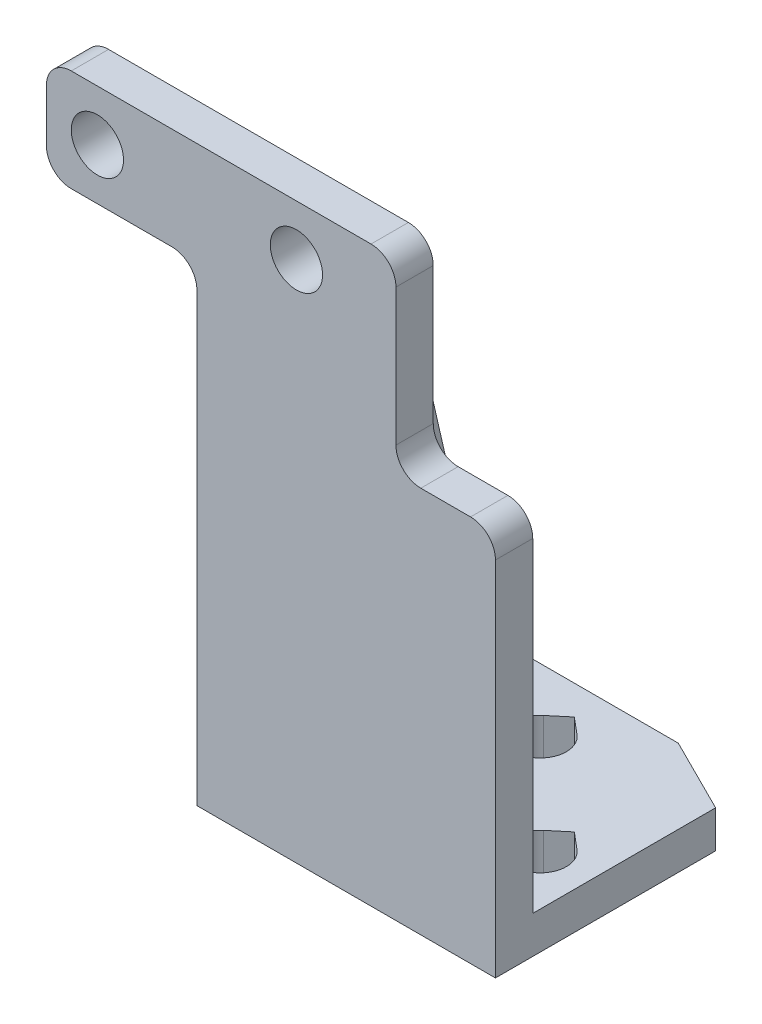
ISO-10303-21;
HEADER;
FILE_DESCRIPTION(('STEP AP214'),'2;1');
FILE_NAME('part.step','',(''),(''),'','','');
FILE_SCHEMA(('AUTOMOTIVE_DESIGN { 1 0 10303 214 1 1 1 1 }'));
ENDSEC;
DATA;
#1=APPLICATION_CONTEXT('core data for automotive mechanical design processes');
#2=APPLICATION_PROTOCOL_DEFINITION('international standard','automotive_design',2000,#1);
#3=PRODUCT_CONTEXT('',#1,'mechanical');
#4=PRODUCT('Part','Part','',(#3));
#5=PRODUCT_RELATED_PRODUCT_CATEGORY('part','',(#4));
#6=PRODUCT_DEFINITION_FORMATION('','',#4);
#7=PRODUCT_DEFINITION_CONTEXT('part definition',#1,'design');
#8=PRODUCT_DEFINITION('design','',#6,#7);
#9=PRODUCT_DEFINITION_SHAPE('','',#8);
#10=(LENGTH_UNIT() NAMED_UNIT(*) SI_UNIT(.MILLI.,.METRE.));
#11=(NAMED_UNIT(*) PLANE_ANGLE_UNIT() SI_UNIT($,.RADIAN.));
#12=(NAMED_UNIT(*) SI_UNIT($,.STERADIAN.) SOLID_ANGLE_UNIT());
#13=UNCERTAINTY_MEASURE_WITH_UNIT(LENGTH_MEASURE(1.E-05),#10,'distance_accuracy_value','');
#14=(GEOMETRIC_REPRESENTATION_CONTEXT(3) GLOBAL_UNCERTAINTY_ASSIGNED_CONTEXT((#13)) GLOBAL_UNIT_ASSIGNED_CONTEXT((#10,
#11,#12)) REPRESENTATION_CONTEXT('',''));
#15=CARTESIAN_POINT('',(0.,0.,0.));
#16=DIRECTION('',(0.,0.,1.));
#17=DIRECTION('',(1.,0.,0.));
#18=AXIS2_PLACEMENT_3D('',#15,#16,#17);
#19=CARTESIAN_POINT('',(0.,3.,0.));
#20=DIRECTION('',(0.,-1.,0.));
#21=DIRECTION('',(0.,0.,1.));
#22=AXIS2_PLACEMENT_3D('',#19,#20,#21);
#23=PLANE('',#22);
#24=CARTESIAN_POINT('',(0.,3.,-12.6));
#25=DIRECTION('',(0.,-1.,0.));
#26=DIRECTION('',(0.,0.,-1.));
#27=AXIS2_PLACEMENT_3D('',#24,#25,#26);
#28=CIRCLE('',#27,2.1);
#29=CARTESIAN_POINT('',(1.34985398034174,3.,-14.2086933305499));
#30=VERTEX_POINT('',#29);
#31=CARTESIAN_POINT('',(-1.34985398034174,3.,-14.2086933305499));
#32=VERTEX_POINT('',#31);
#33=EDGE_CURVE('E381',#30,#32,#28,.T.);
#34=ORIENTED_EDGE('',*,*,#33,.T.);
#35=DIRECTION('',(0.766044443118976,0.,-0.642787609686541));
#36=VECTOR('',#35,1.);
#37=CARTESIAN_POINT('',(-1.34985398034174,3.,-14.2086933305499));
#38=LINE('',#37,#36);
#39=CARTESIAN_POINT('',(0.,3.,-15.3413553075978));
#40=VERTEX_POINT('',#39);
#41=EDGE_CURVE('E384',#32,#40,#38,.T.);
#42=ORIENTED_EDGE('',*,*,#41,.T.);
#43=DIRECTION('',(0.766044443118977,0.,0.64278760968654));
#44=VECTOR('',#43,1.);
#45=CARTESIAN_POINT('',(0.,3.,-15.3413553075978));
#46=LINE('',#45,#44);
#47=EDGE_CURVE('E388',#40,#30,#46,.T.);
#48=ORIENTED_EDGE('',*,*,#47,.T.);
#49=EDGE_LOOP('',(#34,#42,#48));
#50=FACE_BOUND('',#49,.T.);
#51=CARTESIAN_POINT('',(-8.,3.,-4.6));
#52=DIRECTION('',(0.,-1.,0.));
#53=DIRECTION('',(0.,0.,-1.));
#54=AXIS2_PLACEMENT_3D('',#51,#52,#53);
#55=CIRCLE('',#54,2.1);
#56=CARTESIAN_POINT('',(-6.65014601965826,3.,-6.20869333054985));
#57=VERTEX_POINT('',#56);
#58=CARTESIAN_POINT('',(-9.34985398034174,3.,-6.20869333054985));
#59=VERTEX_POINT('',#58);
#60=EDGE_CURVE('E431',#57,#59,#55,.T.);
#61=ORIENTED_EDGE('',*,*,#60,.T.);
#62=DIRECTION('',(0.766044443118977,0.,-0.64278760968654));
#63=VECTOR('',#62,1.);
#64=CARTESIAN_POINT('',(-9.34985398034174,3.,-6.20869333054985));
#65=LINE('',#64,#63);
#66=CARTESIAN_POINT('',(-8.,3.,-7.34135530759779));
#67=VERTEX_POINT('',#66);
#68=EDGE_CURVE('E434',#59,#67,#65,.T.);
#69=ORIENTED_EDGE('',*,*,#68,.T.);
#70=DIRECTION('',(0.766044443118976,0.,0.642787609686542));
#71=VECTOR('',#70,1.);
#72=CARTESIAN_POINT('',(-8.,3.,-7.34135530759779));
#73=LINE('',#72,#71);
#74=EDGE_CURVE('E438',#67,#57,#73,.T.);
#75=ORIENTED_EDGE('',*,*,#74,.T.);
#76=EDGE_LOOP('',(#61,#69,#75));
#77=FACE_BOUND('',#76,.T.);
#78=CARTESIAN_POINT('',(8.,3.,-4.6));
#79=DIRECTION('',(0.,-1.,0.));
#80=DIRECTION('',(0.,0.,-1.));
#81=AXIS2_PLACEMENT_3D('',#78,#79,#80);
#82=CIRCLE('',#81,2.1);
#83=CARTESIAN_POINT('',(9.34985398034174,3.,-6.20869333054985));
#84=VERTEX_POINT('',#83);
#85=CARTESIAN_POINT('',(6.65014601965826,3.,-6.20869333054985));
#86=VERTEX_POINT('',#85);
#87=EDGE_CURVE('E407',#84,#86,#82,.T.);
#88=ORIENTED_EDGE('',*,*,#87,.T.);
#89=DIRECTION('',(0.766044443118977,0.,-0.642787609686541));
#90=VECTOR('',#89,1.);
#91=CARTESIAN_POINT('',(6.65014601965826,3.,-6.20869333054985));
#92=LINE('',#91,#90);
#93=CARTESIAN_POINT('',(8.,3.,-7.34135530759779));
#94=VERTEX_POINT('',#93);
#95=EDGE_CURVE('E410',#86,#94,#92,.T.);
#96=ORIENTED_EDGE('',*,*,#95,.T.);
#97=DIRECTION('',(0.766044443118976,0.,0.642787609686542));
#98=VECTOR('',#97,1.);
#99=CARTESIAN_POINT('',(8.,3.,-7.34135530759779));
#100=LINE('',#99,#98);
#101=EDGE_CURVE('E414',#94,#84,#100,.T.);
#102=ORIENTED_EDGE('',*,*,#101,.T.);
#103=EDGE_LOOP('',(#88,#96,#102));
#104=FACE_BOUND('',#103,.T.);
#105=DIRECTION('',(0.,0.,-1.));
#106=VECTOR('',#105,1.);
#107=CARTESIAN_POINT('',(-12.,3.,-17.7));
#108=LINE('',#107,#106);
#109=CARTESIAN_POINT('',(-12.,3.,0.));
#110=VERTEX_POINT('',#109);
#111=CARTESIAN_POINT('',(-12.,3.,-14.7));
#112=VERTEX_POINT('',#111);
#113=EDGE_CURVE('E254',#110,#112,#108,.T.);
#114=ORIENTED_EDGE('',*,*,#113,.F.);
#115=DIRECTION('',(-1.,0.,0.));
#116=VECTOR('',#115,1.);
#117=CARTESIAN_POINT('',(-12.,3.,0.));
#118=LINE('',#117,#116);
#119=CARTESIAN_POINT('',(-3.,3.,0.));
#120=VERTEX_POINT('',#119);
#121=EDGE_CURVE('E236',#120,#110,#118,.T.);
#122=ORIENTED_EDGE('',*,*,#121,.F.);
#123=DIRECTION('',(0.,0.,1.));
#124=VECTOR('',#123,1.);
#125=CARTESIAN_POINT('',(-3.,3.,0.));
#126=LINE('',#125,#124);
#127=CARTESIAN_POINT('',(-3.,3.,-8.));
#128=VERTEX_POINT('',#127);
#129=EDGE_CURVE('E245',#128,#120,#126,.T.);
#130=ORIENTED_EDGE('',*,*,#129,.F.);
#131=DIRECTION('',(-1.,0.,0.));
#132=VECTOR('',#131,1.);
#133=CARTESIAN_POINT('',(3.,3.,-8.));
#134=LINE('',#133,#132);
#135=CARTESIAN_POINT('',(3.,3.,-8.));
#136=VERTEX_POINT('',#135);
#137=EDGE_CURVE('E765',#136,#128,#134,.T.);
#138=ORIENTED_EDGE('',*,*,#137,.F.);
#139=DIRECTION('',(0.,0.,1.));
#140=VECTOR('',#139,1.);
#141=CARTESIAN_POINT('',(3.,3.,0.));
#142=LINE('',#141,#140);
#143=CARTESIAN_POINT('',(3.,3.,0.));
#144=VERTEX_POINT('',#143);
#145=EDGE_CURVE('E760',#136,#144,#142,.T.);
#146=ORIENTED_EDGE('',*,*,#145,.T.);
#147=CARTESIAN_POINT('',(12.,3.,0.));
#148=VERTEX_POINT('',#147);
#149=EDGE_CURVE('E255',#148,#144,#118,.T.);
#150=ORIENTED_EDGE('',*,*,#149,.F.);
#151=DIRECTION('',(0.,0.,1.));
#152=VECTOR('',#151,1.);
#153=CARTESIAN_POINT('',(12.,3.,-17.7));
#154=LINE('',#153,#152);
#155=CARTESIAN_POINT('',(12.,3.,-14.7));
#156=VERTEX_POINT('',#155);
#157=EDGE_CURVE('E256',#156,#148,#154,.T.);
#158=ORIENTED_EDGE('',*,*,#157,.F.);
#159=DIRECTION('',(-0.894427190999917,0.,-0.447213595499956));
#160=VECTOR('',#159,1.);
#161=CARTESIAN_POINT('',(12.,3.,-14.7));
#162=LINE('',#161,#160);
#163=CARTESIAN_POINT('',(5.99999999999996,3.,-17.7));
#164=VERTEX_POINT('',#163);
#165=EDGE_CURVE('E284',#164,#156,#162,.F.);
#166=ORIENTED_EDGE('',*,*,#165,.F.);
#167=DIRECTION('',(1.,0.,0.));
#168=VECTOR('',#167,1.);
#169=CARTESIAN_POINT('',(-12.,3.,-17.7));
#170=LINE('',#169,#168);
#171=CARTESIAN_POINT('',(-5.99999999999996,3.,-17.7));
#172=VERTEX_POINT('',#171);
#173=EDGE_CURVE('E265',#172,#164,#170,.T.);
#174=ORIENTED_EDGE('',*,*,#173,.F.);
#175=DIRECTION('',(-0.894427190999917,0.,0.447213595499957));
#176=VECTOR('',#175,1.);
#177=CARTESIAN_POINT('',(-5.99999999999995,3.,-17.7));
#178=LINE('',#177,#176);
#179=EDGE_CURVE('E294',#112,#172,#178,.F.);
#180=ORIENTED_EDGE('',*,*,#179,.F.);
#181=EDGE_LOOP('',(#114,#122,#130,#138,#146,#150,#158,#166,#174,#180));
#182=FACE_BOUND('',#181,.T.);
#183=ADVANCED_FACE('F35',(#50,#77,#104,#182),#23,.F.);
#184=CARTESIAN_POINT('',(0.,0.,0.));
#185=DIRECTION('',(0.,0.,-1.));
#186=DIRECTION('',(1.,0.,0.));
#187=AXIS2_PLACEMENT_3D('',#184,#185,#186);
#188=PLANE('',#187);
#189=CARTESIAN_POINT('',(-20.,42.,0.));
#190=DIRECTION('',(0.,0.,1.));
#191=DIRECTION('',(1.,0.,0.));
#192=AXIS2_PLACEMENT_3D('',#189,#190,#191);
#193=CIRCLE('',#192,2.1);
#194=CARTESIAN_POINT('',(-17.9,42.,0.));
#195=VERTEX_POINT('',#194);
#196=EDGE_CURVE('E585',#195,#195,#193,.T.);
#197=ORIENTED_EDGE('',*,*,#196,.T.);
#198=EDGE_LOOP('',(#197));
#199=FACE_BOUND('',#198,.T.);
#200=CARTESIAN_POINT('',(-4.,42.,0.));
#201=DIRECTION('',(0.,0.,1.));
#202=DIRECTION('',(1.,0.,0.));
#203=AXIS2_PLACEMENT_3D('',#200,#201,#202);
#204=CIRCLE('',#203,2.1);
#205=CARTESIAN_POINT('',(-1.9,42.,0.));
#206=VERTEX_POINT('',#205);
#207=EDGE_CURVE('E593',#206,#206,#204,.T.);
#208=ORIENTED_EDGE('',*,*,#207,.T.);
#209=EDGE_LOOP('',(#208));
#210=FACE_BOUND('',#209,.T.);
#211=DIRECTION('',(0.,1.,0.));
#212=VECTOR('',#211,1.);
#213=CARTESIAN_POINT('',(12.,0.,0.));
#214=LINE('',#213,#212);
#215=CARTESIAN_POINT('',(12.,29.1,0.));
#216=VERTEX_POINT('',#215);
#217=EDGE_CURVE('E369',#148,#216,#214,.T.);
#218=ORIENTED_EDGE('',*,*,#217,.F.);
#219=ORIENTED_EDGE('',*,*,#149,.T.);
#220=DIRECTION('',(0.,1.,0.));
#221=VECTOR('',#220,1.);
#222=CARTESIAN_POINT('',(3.,38.,0.));
#223=LINE('',#222,#221);
#224=CARTESIAN_POINT('',(3.,38.,0.));
#225=VERTEX_POINT('',#224);
#226=EDGE_CURVE('E250',#144,#225,#223,.T.);
#227=ORIENTED_EDGE('',*,*,#226,.T.);
#228=DIRECTION('',(-1.,0.,0.));
#229=VECTOR('',#228,1.);
#230=CARTESIAN_POINT('',(3.,38.,0.));
#231=LINE('',#230,#229);
#232=CARTESIAN_POINT('',(-3.,38.,0.));
#233=VERTEX_POINT('',#232);
#234=EDGE_CURVE('E240',#225,#233,#231,.T.);
#235=ORIENTED_EDGE('',*,*,#234,.T.);
#236=DIRECTION('',(0.,1.,0.));
#237=VECTOR('',#236,1.);
#238=CARTESIAN_POINT('',(-3.,38.,0.));
#239=LINE('',#238,#237);
#240=EDGE_CURVE('E231',#120,#233,#239,.T.);
#241=ORIENTED_EDGE('',*,*,#240,.F.);
#242=ORIENTED_EDGE('',*,*,#121,.T.);
#243=DIRECTION('',(0.,-1.,0.));
#244=VECTOR('',#243,1.);
#245=CARTESIAN_POINT('',(-12.,0.,0.));
#246=LINE('',#245,#244);
#247=CARTESIAN_POINT('',(-12.,35.9,0.));
#248=VERTEX_POINT('',#247);
#249=EDGE_CURVE('E378',#248,#110,#246,.T.);
#250=ORIENTED_EDGE('',*,*,#249,.F.);
#251=CARTESIAN_POINT('',(-14.,35.9,0.));
#252=DIRECTION('',(0.,0.,1.));
#253=DIRECTION('',(1.,0.,0.));
#254=AXIS2_PLACEMENT_3D('',#251,#252,#253);
#255=CIRCLE('',#254,2.);
#256=CARTESIAN_POINT('',(-14.,37.9,0.));
#257=VERTEX_POINT('',#256);
#258=EDGE_CURVE('E344',#257,#248,#255,.F.);
#259=ORIENTED_EDGE('',*,*,#258,.F.);
#260=DIRECTION('',(1.,0.,0.));
#261=VECTOR('',#260,1.);
#262=CARTESIAN_POINT('',(-12.,37.9,0.));
#263=LINE('',#262,#261);
#264=CARTESIAN_POINT('',(-22.1,37.9,0.));
#265=VERTEX_POINT('',#264);
#266=EDGE_CURVE('E375',#265,#257,#263,.T.);
#267=ORIENTED_EDGE('',*,*,#266,.F.);
#268=CARTESIAN_POINT('',(-22.1,39.9,0.));
#269=DIRECTION('',(0.,0.,1.));
#270=DIRECTION('',(1.,0.,0.));
#271=AXIS2_PLACEMENT_3D('',#268,#269,#270);
#272=CIRCLE('',#271,2.);
#273=CARTESIAN_POINT('',(-24.1,39.9,0.));
#274=VERTEX_POINT('',#273);
#275=EDGE_CURVE('E310',#274,#265,#272,.T.);
#276=ORIENTED_EDGE('',*,*,#275,.F.);
#277=DIRECTION('',(0.,-1.,0.));
#278=VECTOR('',#277,1.);
#279=CARTESIAN_POINT('',(-24.1,46.1,0.));
#280=LINE('',#279,#278);
#281=CARTESIAN_POINT('',(-24.1,44.1,0.));
#282=VERTEX_POINT('',#281);
#283=EDGE_CURVE('E367',#282,#274,#280,.T.);
#284=ORIENTED_EDGE('',*,*,#283,.F.);
#285=CARTESIAN_POINT('',(-22.1,44.1,0.));
#286=DIRECTION('',(0.,0.,1.));
#287=DIRECTION('',(1.,0.,0.));
#288=AXIS2_PLACEMENT_3D('',#285,#286,#287);
#289=CIRCLE('',#288,2.);
#290=CARTESIAN_POINT('',(-22.1,46.1,0.));
#291=VERTEX_POINT('',#290);
#292=EDGE_CURVE('E307',#291,#282,#289,.T.);
#293=ORIENTED_EDGE('',*,*,#292,.F.);
#294=DIRECTION('',(-1.,0.,0.));
#295=VECTOR('',#294,1.);
#296=CARTESIAN_POINT('',(-12.,46.1,0.));
#297=LINE('',#296,#295);
#298=CARTESIAN_POINT('',(2.,46.1,0.));
#299=VERTEX_POINT('',#298);
#300=EDGE_CURVE('E363',#299,#291,#297,.T.);
#301=ORIENTED_EDGE('',*,*,#300,.F.);
#302=CARTESIAN_POINT('',(2.,44.1,0.));
#303=DIRECTION('',(0.,0.,1.));
#304=DIRECTION('',(1.,0.,0.));
#305=AXIS2_PLACEMENT_3D('',#302,#303,#304);
#306=CIRCLE('',#305,2.);
#307=CARTESIAN_POINT('',(4.,44.1,0.));
#308=VERTEX_POINT('',#307);
#309=EDGE_CURVE('E313',#308,#299,#306,.T.);
#310=ORIENTED_EDGE('',*,*,#309,.F.);
#311=DIRECTION('',(0.,1.,0.));
#312=VECTOR('',#311,1.);
#313=CARTESIAN_POINT('',(4.,31.1,0.));
#314=LINE('',#313,#312);
#315=CARTESIAN_POINT('',(4.,33.1,0.));
#316=VERTEX_POINT('',#315);
#317=EDGE_CURVE('E359',#316,#308,#314,.T.);
#318=ORIENTED_EDGE('',*,*,#317,.F.);
#319=CARTESIAN_POINT('',(6.,33.1,0.));
#320=DIRECTION('',(0.,0.,1.));
#321=DIRECTION('',(1.,0.,0.));
#322=AXIS2_PLACEMENT_3D('',#319,#320,#321);
#323=CIRCLE('',#322,2.);
#324=CARTESIAN_POINT('',(6.,31.1,0.));
#325=VERTEX_POINT('',#324);
#326=EDGE_CURVE('E43',#325,#316,#323,.F.);
#327=ORIENTED_EDGE('',*,*,#326,.F.);
#328=DIRECTION('',(-1.,0.,0.));
#329=VECTOR('',#328,1.);
#330=CARTESIAN_POINT('',(12.,31.1,0.));
#331=LINE('',#330,#329);
#332=CARTESIAN_POINT('',(10.,31.1,0.));
#333=VERTEX_POINT('',#332);
#334=EDGE_CURVE('E364',#333,#325,#331,.T.);
#335=ORIENTED_EDGE('',*,*,#334,.F.);
#336=CARTESIAN_POINT('',(10.,29.1,0.));
#337=DIRECTION('',(0.,0.,1.));
#338=DIRECTION('',(1.,0.,0.));
#339=AXIS2_PLACEMENT_3D('',#336,#337,#338);
#340=CIRCLE('',#339,2.);
#341=EDGE_CURVE('E316',#216,#333,#340,.T.);
#342=ORIENTED_EDGE('',*,*,#341,.F.);
#343=EDGE_LOOP('',(#218,#219,#227,#235,#241,#242,#250,#259,#267,#276,#284,#293,#301,#310,#318,
#327,#335,#342));
#344=FACE_BOUND('',#343,.T.);
#345=ADVANCED_FACE('F233',(#199,#210,#344),#188,.T.);
#346=CARTESIAN_POINT('',(0.,0.,0.));
#347=DIRECTION('',(0.,-1.,0.));
#348=DIRECTION('',(0.,0.,1.));
#349=AXIS2_PLACEMENT_3D('',#346,#347,#348);
#350=PLANE('',#349);
#351=DIRECTION('',(1.,0.,0.));
#352=VECTOR('',#351,1.);
#353=CARTESIAN_POINT('',(-12.,0.,-17.7));
#354=LINE('',#353,#352);
#355=CARTESIAN_POINT('',(-5.99999999999996,0.,-17.7));
#356=VERTEX_POINT('',#355);
#357=CARTESIAN_POINT('',(5.99999999999996,0.,-17.7));
#358=VERTEX_POINT('',#357);
#359=EDGE_CURVE('E260',#356,#358,#354,.T.);
#360=ORIENTED_EDGE('',*,*,#359,.T.);
#361=DIRECTION('',(0.894427190999917,0.,0.447213595499956));
#362=VECTOR('',#361,1.);
#363=CARTESIAN_POINT('',(8.27999999999996,0.,-16.56));
#364=LINE('',#363,#362);
#365=CARTESIAN_POINT('',(12.,0.,-14.7));
#366=VERTEX_POINT('',#365);
#367=EDGE_CURVE('E279',#366,#358,#364,.F.);
#368=ORIENTED_EDGE('',*,*,#367,.F.);
#369=DIRECTION('',(0.,0.,1.));
#370=VECTOR('',#369,1.);
#371=CARTESIAN_POINT('',(12.,0.,-17.7));
#372=LINE('',#371,#370);
#373=CARTESIAN_POINT('',(12.,0.,3.));
#374=VERTEX_POINT('',#373);
#375=EDGE_CURVE('E269',#366,#374,#372,.T.);
#376=ORIENTED_EDGE('',*,*,#375,.T.);
#377=DIRECTION('',(1.,0.,0.));
#378=VECTOR('',#377,1.);
#379=CARTESIAN_POINT('',(12.,0.,3.));
#380=LINE('',#379,#378);
#381=CARTESIAN_POINT('',(-12.,0.,3.));
#382=VERTEX_POINT('',#381);
#383=EDGE_CURVE('E396',#382,#374,#380,.T.);
#384=ORIENTED_EDGE('',*,*,#383,.F.);
#385=DIRECTION('',(0.,0.,-1.));
#386=VECTOR('',#385,1.);
#387=CARTESIAN_POINT('',(-12.,0.,-17.7));
#388=LINE('',#387,#386);
#389=CARTESIAN_POINT('',(-12.,0.,-14.7));
#390=VERTEX_POINT('',#389);
#391=EDGE_CURVE('E272',#382,#390,#388,.T.);
#392=ORIENTED_EDGE('',*,*,#391,.T.);
#393=DIRECTION('',(0.894427190999917,0.,-0.447213595499957));
#394=VECTOR('',#393,1.);
#395=CARTESIAN_POINT('',(-8.27999999999997,0.,-16.56));
#396=LINE('',#395,#394);
#397=EDGE_CURVE('E289',#356,#390,#396,.F.);
#398=ORIENTED_EDGE('',*,*,#397,.F.);
#399=EDGE_LOOP('',(#360,#368,#376,#384,#392,#398));
#400=FACE_BOUND('',#399,.T.);
#401=DIRECTION('',(0.766044443118976,0.,0.642787609686542));
#402=VECTOR('',#401,1.);
#403=CARTESIAN_POINT('',(-8.,0.,-7.34135530759779));
#404=LINE('',#403,#402);
#405=CARTESIAN_POINT('',(-8.,0.,-7.34135530759779));
#406=VERTEX_POINT('',#405);
#407=CARTESIAN_POINT('',(-6.65014601965826,0.,-6.20869333054985));
#408=VERTEX_POINT('',#407);
#409=EDGE_CURVE('E435',#406,#408,#404,.T.);
#410=ORIENTED_EDGE('',*,*,#409,.F.);
#411=DIRECTION('',(0.766044443118977,0.,-0.64278760968654));
#412=VECTOR('',#411,1.);
#413=CARTESIAN_POINT('',(-9.34985398034174,0.,-6.20869333054985));
#414=LINE('',#413,#412);
#415=CARTESIAN_POINT('',(-9.34985398034174,0.,-6.20869333054985));
#416=VERTEX_POINT('',#415);
#417=EDGE_CURVE('E444',#416,#406,#414,.T.);
#418=ORIENTED_EDGE('',*,*,#417,.F.);
#419=CARTESIAN_POINT('',(-8.,0.,-4.6));
#420=DIRECTION('',(0.,-1.,0.));
#421=DIRECTION('',(0.,0.,-1.));
#422=AXIS2_PLACEMENT_3D('',#419,#420,#421);
#423=CIRCLE('',#422,2.1);
#424=EDGE_CURVE('E430',#408,#416,#423,.T.);
#425=ORIENTED_EDGE('',*,*,#424,.F.);
#426=EDGE_LOOP('',(#410,#418,#425));
#427=FACE_BOUND('',#426,.T.);
#428=DIRECTION('',(0.766044443118976,0.,0.642787609686542));
#429=VECTOR('',#428,1.);
#430=CARTESIAN_POINT('',(8.,0.,-7.34135530759779));
#431=LINE('',#430,#429);
#432=CARTESIAN_POINT('',(8.,0.,-7.34135530759779));
#433=VERTEX_POINT('',#432);
#434=CARTESIAN_POINT('',(9.34985398034174,0.,-6.20869333054985));
#435=VERTEX_POINT('',#434);
#436=EDGE_CURVE('E411',#433,#435,#431,.T.);
#437=ORIENTED_EDGE('',*,*,#436,.F.);
#438=DIRECTION('',(0.766044443118977,0.,-0.642787609686541));
#439=VECTOR('',#438,1.);
#440=CARTESIAN_POINT('',(6.65014601965826,0.,-6.20869333054985));
#441=LINE('',#440,#439);
#442=CARTESIAN_POINT('',(6.65014601965826,0.,-6.20869333054985));
#443=VERTEX_POINT('',#442);
#444=EDGE_CURVE('E420',#443,#433,#441,.T.);
#445=ORIENTED_EDGE('',*,*,#444,.F.);
#446=CARTESIAN_POINT('',(8.,0.,-4.6));
#447=DIRECTION('',(0.,-1.,0.));
#448=DIRECTION('',(0.,0.,-1.));
#449=AXIS2_PLACEMENT_3D('',#446,#447,#448);
#450=CIRCLE('',#449,2.1);
#451=EDGE_CURVE('E406',#435,#443,#450,.T.);
#452=ORIENTED_EDGE('',*,*,#451,.F.);
#453=EDGE_LOOP('',(#437,#445,#452));
#454=FACE_BOUND('',#453,.T.);
#455=DIRECTION('',(0.766044443118977,0.,0.64278760968654));
#456=VECTOR('',#455,1.);
#457=CARTESIAN_POINT('',(0.,0.,-15.3413553075978));
#458=LINE('',#457,#456);
#459=CARTESIAN_POINT('',(0.,0.,-15.3413553075978));
#460=VERTEX_POINT('',#459);
#461=CARTESIAN_POINT('',(1.34985398034174,0.,-14.2086933305499));
#462=VERTEX_POINT('',#461);
#463=EDGE_CURVE('E385',#460,#462,#458,.T.);
#464=ORIENTED_EDGE('',*,*,#463,.F.);
#465=DIRECTION('',(0.766044443118976,0.,-0.642787609686541));
#466=VECTOR('',#465,1.);
#467=CARTESIAN_POINT('',(-1.34985398034174,0.,-14.2086933305499));
#468=LINE('',#467,#466);
#469=CARTESIAN_POINT('',(-1.34985398034174,0.,-14.2086933305499));
#470=VERTEX_POINT('',#469);
#471=EDGE_CURVE('E395',#470,#460,#468,.T.);
#472=ORIENTED_EDGE('',*,*,#471,.F.);
#473=CARTESIAN_POINT('',(0.,0.,-12.6));
#474=DIRECTION('',(0.,-1.,0.));
#475=DIRECTION('',(0.,0.,-1.));
#476=AXIS2_PLACEMENT_3D('',#473,#474,#475);
#477=CIRCLE('',#476,2.1);
#478=EDGE_CURVE('E392',#462,#470,#477,.T.);
#479=ORIENTED_EDGE('',*,*,#478,.F.);
#480=EDGE_LOOP('',(#464,#472,#479));
#481=FACE_BOUND('',#480,.T.);
#482=ADVANCED_FACE('F461',(#400,#427,#454,#481),#350,.T.);
#483=CARTESIAN_POINT('',(12.,3.,-17.7));
#484=DIRECTION('',(-1.,0.,0.));
#485=DIRECTION('',(0.,0.,-1.));
#486=AXIS2_PLACEMENT_3D('',#483,#484,#485);
#487=PLANE('',#486);
#488=DIRECTION('',(0.,1.,0.));
#489=VECTOR('',#488,1.);
#490=CARTESIAN_POINT('',(12.,0.,3.));
#491=LINE('',#490,#489);
#492=CARTESIAN_POINT('',(12.,29.1,3.));
#493=VERTEX_POINT('',#492);
#494=EDGE_CURVE('E380',#374,#493,#491,.T.);
#495=ORIENTED_EDGE('',*,*,#494,.F.);
#496=ORIENTED_EDGE('',*,*,#375,.F.);
#497=DIRECTION('',(0.,-1.,0.));
#498=VECTOR('',#497,1.);
#499=CARTESIAN_POINT('',(12.,3.,-14.7));
#500=LINE('',#499,#498);
#501=EDGE_CURVE('E268',#156,#366,#500,.T.);
#502=ORIENTED_EDGE('',*,*,#501,.F.);
#503=ORIENTED_EDGE('',*,*,#157,.T.);
#504=ORIENTED_EDGE('',*,*,#217,.T.);
#505=DIRECTION('',(0.,0.,-1.));
#506=VECTOR('',#505,1.);
#507=CARTESIAN_POINT('',(12.,29.1,0.));
#508=LINE('',#507,#506);
#509=EDGE_CURVE('E305',#493,#216,#508,.T.);
#510=ORIENTED_EDGE('',*,*,#509,.F.);
#511=EDGE_LOOP('',(#495,#496,#502,#503,#504,#510));
#512=FACE_BOUND('',#511,.T.);
#513=ADVANCED_FACE('F485',(#512),#487,.F.);
#514=CARTESIAN_POINT('',(-12.,3.,-17.7));
#515=DIRECTION('',(1.,0.,0.));
#516=DIRECTION('',(0.,0.,1.));
#517=AXIS2_PLACEMENT_3D('',#514,#515,#516);
#518=PLANE('',#517);
#519=ORIENTED_EDGE('',*,*,#249,.T.);
#520=ORIENTED_EDGE('',*,*,#113,.T.);
#521=DIRECTION('',(0.,1.,0.));
#522=VECTOR('',#521,1.);
#523=CARTESIAN_POINT('',(-12.,3.,-14.7));
#524=LINE('',#523,#522);
#525=EDGE_CURVE('E292',#390,#112,#524,.T.);
#526=ORIENTED_EDGE('',*,*,#525,.F.);
#527=ORIENTED_EDGE('',*,*,#391,.F.);
#528=DIRECTION('',(0.,-1.,0.));
#529=VECTOR('',#528,1.);
#530=CARTESIAN_POINT('',(-12.,0.,3.));
#531=LINE('',#530,#529);
#532=CARTESIAN_POINT('',(-12.,35.9,3.));
#533=VERTEX_POINT('',#532);
#534=EDGE_CURVE('E573',#533,#382,#531,.T.);
#535=ORIENTED_EDGE('',*,*,#534,.F.);
#536=DIRECTION('',(0.,0.,-1.));
#537=VECTOR('',#536,1.);
#538=CARTESIAN_POINT('',(-12.,35.9,-17.7));
#539=LINE('',#538,#537);
#540=EDGE_CURVE('E302',#248,#533,#539,.F.);
#541=ORIENTED_EDGE('',*,*,#540,.F.);
#542=EDGE_LOOP('',(#519,#520,#526,#527,#535,#541));
#543=FACE_BOUND('',#542,.T.);
#544=ADVANCED_FACE('F523',(#543),#518,.F.);
#545=CARTESIAN_POINT('',(-12.,3.,-17.7));
#546=DIRECTION('',(0.,0.,1.));
#547=DIRECTION('',(-1.,0.,0.));
#548=AXIS2_PLACEMENT_3D('',#545,#546,#547);
#549=PLANE('',#548);
#550=ORIENTED_EDGE('',*,*,#173,.T.);
#551=DIRECTION('',(0.,1.,0.));
#552=VECTOR('',#551,1.);
#553=CARTESIAN_POINT('',(5.99999999999996,3.,-17.7));
#554=LINE('',#553,#552);
#555=EDGE_CURVE('E282',#358,#164,#554,.T.);
#556=ORIENTED_EDGE('',*,*,#555,.F.);
#557=ORIENTED_EDGE('',*,*,#359,.F.);
#558=DIRECTION('',(0.,-1.,0.));
#559=VECTOR('',#558,1.);
#560=CARTESIAN_POINT('',(-5.99999999999996,3.,-17.7));
#561=LINE('',#560,#559);
#562=EDGE_CURVE('E287',#172,#356,#561,.T.);
#563=ORIENTED_EDGE('',*,*,#562,.F.);
#564=EDGE_LOOP('',(#550,#556,#557,#563));
#565=FACE_BOUND('',#564,.T.);
#566=ADVANCED_FACE('F519',(#565),#549,.F.);
#567=CARTESIAN_POINT('',(-8.,3.,-4.6));
#568=DIRECTION('',(0.,-1.,0.));
#569=DIRECTION('',(0.,0.,1.));
#570=AXIS2_PLACEMENT_3D('',#567,#568,#569);
#571=CYLINDRICAL_SURFACE('',#570,2.1);
#572=ORIENTED_EDGE('',*,*,#424,.T.);
#573=DIRECTION('',(0.,-1.,0.));
#574=VECTOR('',#573,1.);
#575=CARTESIAN_POINT('',(-9.34985398034174,3.,-6.20869333054985));
#576=LINE('',#575,#574);
#577=EDGE_CURVE('E273',#59,#416,#576,.T.);
#578=ORIENTED_EDGE('',*,*,#577,.F.);
#579=ORIENTED_EDGE('',*,*,#60,.F.);
#580=DIRECTION('',(0.,-1.,0.));
#581=VECTOR('',#580,1.);
#582=CARTESIAN_POINT('',(-6.65014601965826,3.,-6.20869333054985));
#583=LINE('',#582,#581);
#584=EDGE_CURVE('E441',#57,#408,#583,.T.);
#585=ORIENTED_EDGE('',*,*,#584,.T.);
#586=EDGE_LOOP('',(#572,#578,#579,#585));
#587=FACE_BOUND('',#586,.T.);
#588=ADVANCED_FACE('F459',(#587),#571,.F.);
#589=CARTESIAN_POINT('',(-9.34985398034174,3.,-6.20869333054985));
#590=DIRECTION('',(0.64278760968654,0.,0.766044443118978));
#591=DIRECTION('',(-0.766044443118978,0.,0.64278760968654));
#592=AXIS2_PLACEMENT_3D('',#589,#590,#591);
#593=PLANE('',#592);
#594=ORIENTED_EDGE('',*,*,#417,.T.);
#595=DIRECTION('',(0.,-1.,0.));
#596=VECTOR('',#595,1.);
#597=CARTESIAN_POINT('',(-8.,3.,-7.34135530759779));
#598=LINE('',#597,#596);
#599=EDGE_CURVE('E450',#67,#406,#598,.T.);
#600=ORIENTED_EDGE('',*,*,#599,.F.);
#601=ORIENTED_EDGE('',*,*,#68,.F.);
#602=ORIENTED_EDGE('',*,*,#577,.T.);
#603=EDGE_LOOP('',(#594,#600,#601,#602));
#604=FACE_BOUND('',#603,.T.);
#605=ADVANCED_FACE('F453',(#604),#593,.T.);
#606=CARTESIAN_POINT('',(-8.,3.,-7.34135530759779));
#607=DIRECTION('',(-0.642787609686542,0.,0.766044443118976));
#608=DIRECTION('',(-0.766044443118976,0.,-0.642787609686542));
#609=AXIS2_PLACEMENT_3D('',#606,#607,#608);
#610=PLANE('',#609);
#611=ORIENTED_EDGE('',*,*,#409,.T.);
#612=ORIENTED_EDGE('',*,*,#584,.F.);
#613=ORIENTED_EDGE('',*,*,#74,.F.);
#614=ORIENTED_EDGE('',*,*,#599,.T.);
#615=EDGE_LOOP('',(#611,#612,#613,#614));
#616=FACE_BOUND('',#615,.T.);
#617=ADVANCED_FACE('F464',(#616),#610,.T.);
#618=CARTESIAN_POINT('',(8.,3.,-4.6));
#619=DIRECTION('',(0.,-1.,0.));
#620=DIRECTION('',(0.,0.,1.));
#621=AXIS2_PLACEMENT_3D('',#618,#619,#620);
#622=CYLINDRICAL_SURFACE('',#621,2.1);
#623=ORIENTED_EDGE('',*,*,#451,.T.);
#624=DIRECTION('',(0.,-1.,0.));
#625=VECTOR('',#624,1.);
#626=CARTESIAN_POINT('',(6.65014601965826,3.,-6.20869333054985));
#627=LINE('',#626,#625);
#628=EDGE_CURVE('E428',#86,#443,#627,.T.);
#629=ORIENTED_EDGE('',*,*,#628,.F.);
#630=ORIENTED_EDGE('',*,*,#87,.F.);
#631=DIRECTION('',(0.,-1.,0.));
#632=VECTOR('',#631,1.);
#633=CARTESIAN_POINT('',(9.34985398034174,3.,-6.20869333054985));
#634=LINE('',#633,#632);
#635=EDGE_CURVE('E417',#84,#435,#634,.T.);
#636=ORIENTED_EDGE('',*,*,#635,.T.);
#637=EDGE_LOOP('',(#623,#629,#630,#636));
#638=FACE_BOUND('',#637,.T.);
#639=ADVANCED_FACE('F475',(#638),#622,.F.);
#640=CARTESIAN_POINT('',(6.65014601965826,3.,-6.20869333054985));
#641=DIRECTION('',(0.642787609686541,0.,0.766044443118977));
#642=DIRECTION('',(-0.766044443118977,0.,0.642787609686541));
#643=AXIS2_PLACEMENT_3D('',#640,#641,#642);
#644=PLANE('',#643);
#645=ORIENTED_EDGE('',*,*,#444,.T.);
#646=DIRECTION('',(0.,-1.,0.));
#647=VECTOR('',#646,1.);
#648=CARTESIAN_POINT('',(8.,3.,-7.34135530759779));
#649=LINE('',#648,#647);
#650=EDGE_CURVE('E426',#94,#433,#649,.T.);
#651=ORIENTED_EDGE('',*,*,#650,.F.);
#652=ORIENTED_EDGE('',*,*,#95,.F.);
#653=ORIENTED_EDGE('',*,*,#628,.T.);
#654=EDGE_LOOP('',(#645,#651,#652,#653));
#655=FACE_BOUND('',#654,.T.);
#656=ADVANCED_FACE('F479',(#655),#644,.T.);
#657=CARTESIAN_POINT('',(8.,3.,-7.34135530759779));
#658=DIRECTION('',(-0.642787609686542,0.,0.766044443118976));
#659=DIRECTION('',(-0.766044443118976,0.,-0.642787609686542));
#660=AXIS2_PLACEMENT_3D('',#657,#658,#659);
#661=PLANE('',#660);
#662=ORIENTED_EDGE('',*,*,#436,.T.);
#663=ORIENTED_EDGE('',*,*,#635,.F.);
#664=ORIENTED_EDGE('',*,*,#101,.F.);
#665=ORIENTED_EDGE('',*,*,#650,.T.);
#666=EDGE_LOOP('',(#662,#663,#664,#665));
#667=FACE_BOUND('',#666,.T.);
#668=ADVANCED_FACE('F482',(#667),#661,.T.);
#669=CARTESIAN_POINT('',(0.,3.,-12.6));
#670=DIRECTION('',(0.,-1.,0.));
#671=DIRECTION('',(0.,0.,1.));
#672=AXIS2_PLACEMENT_3D('',#669,#670,#671);
#673=CYLINDRICAL_SURFACE('',#672,2.1);
#674=ORIENTED_EDGE('',*,*,#478,.T.);
#675=DIRECTION('',(0.,-1.,0.));
#676=VECTOR('',#675,1.);
#677=CARTESIAN_POINT('',(-1.34985398034174,3.,-14.2086933305499));
#678=LINE('',#677,#676);
#679=EDGE_CURVE('E404',#32,#470,#678,.T.);
#680=ORIENTED_EDGE('',*,*,#679,.F.);
#681=ORIENTED_EDGE('',*,*,#33,.F.);
#682=DIRECTION('',(0.,-1.,0.));
#683=VECTOR('',#682,1.);
#684=CARTESIAN_POINT('',(1.34985398034174,3.,-14.2086933305499));
#685=LINE('',#684,#683);
#686=EDGE_CURVE('E391',#30,#462,#685,.T.);
#687=ORIENTED_EDGE('',*,*,#686,.T.);
#688=EDGE_LOOP('',(#674,#680,#681,#687));
#689=FACE_BOUND('',#688,.T.);
#690=ADVANCED_FACE('F499',(#689),#673,.F.);
#691=CARTESIAN_POINT('',(-1.34985398034174,3.,-14.2086933305499));
#692=DIRECTION('',(0.642787609686541,0.,0.766044443118976));
#693=DIRECTION('',(-0.766044443118976,0.,0.642787609686541));
#694=AXIS2_PLACEMENT_3D('',#691,#692,#693);
#695=PLANE('',#694);
#696=ORIENTED_EDGE('',*,*,#471,.T.);
#697=DIRECTION('',(0.,-1.,0.));
#698=VECTOR('',#697,1.);
#699=CARTESIAN_POINT('',(0.,3.,-15.3413553075978));
#700=LINE('',#699,#698);
#701=EDGE_CURVE('E402',#40,#460,#700,.T.);
#702=ORIENTED_EDGE('',*,*,#701,.F.);
#703=ORIENTED_EDGE('',*,*,#41,.F.);
#704=ORIENTED_EDGE('',*,*,#679,.T.);
#705=EDGE_LOOP('',(#696,#702,#703,#704));
#706=FACE_BOUND('',#705,.T.);
#707=ADVANCED_FACE('F496',(#706),#695,.T.);
#708=CARTESIAN_POINT('',(0.,3.,-15.3413553075978));
#709=DIRECTION('',(-0.642787609686541,0.,0.766044443118977));
#710=DIRECTION('',(-0.766044443118977,0.,-0.642787609686541));
#711=AXIS2_PLACEMENT_3D('',#708,#709,#710);
#712=PLANE('',#711);
#713=ORIENTED_EDGE('',*,*,#463,.T.);
#714=ORIENTED_EDGE('',*,*,#686,.F.);
#715=ORIENTED_EDGE('',*,*,#47,.F.);
#716=ORIENTED_EDGE('',*,*,#701,.T.);
#717=EDGE_LOOP('',(#713,#714,#715,#716));
#718=FACE_BOUND('',#717,.T.);
#719=ADVANCED_FACE('F492',(#718),#712,.T.);
#720=CARTESIAN_POINT('',(-12.,37.9,3.));
#721=DIRECTION('',(0.,-1.,0.));
#722=DIRECTION('',(0.,0.,1.));
#723=AXIS2_PLACEMENT_3D('',#720,#721,#722);
#724=PLANE('',#723);
#725=DIRECTION('',(1.,0.,0.));
#726=VECTOR('',#725,1.);
#727=CARTESIAN_POINT('',(-12.,37.9,3.));
#728=LINE('',#727,#726);
#729=CARTESIAN_POINT('',(-22.1,37.9,3.));
#730=VERTEX_POINT('',#729);
#731=CARTESIAN_POINT('',(-14.,37.9,3.));
#732=VERTEX_POINT('',#731);
#733=EDGE_CURVE('E570',#730,#732,#728,.T.);
#734=ORIENTED_EDGE('',*,*,#733,.F.);
#735=DIRECTION('',(0.,0.,-1.));
#736=VECTOR('',#735,1.);
#737=CARTESIAN_POINT('',(-22.1,37.9,3.));
#738=LINE('',#737,#736);
#739=EDGE_CURVE('E297',#265,#730,#738,.F.);
#740=ORIENTED_EDGE('',*,*,#739,.F.);
#741=ORIENTED_EDGE('',*,*,#266,.T.);
#742=DIRECTION('',(0.,0.,-1.));
#743=VECTOR('',#742,1.);
#744=CARTESIAN_POINT('',(-14.,37.9,3.));
#745=LINE('',#744,#743);
#746=EDGE_CURVE('E300',#732,#257,#745,.T.);
#747=ORIENTED_EDGE('',*,*,#746,.F.);
#748=EDGE_LOOP('',(#734,#740,#741,#747));
#749=FACE_BOUND('',#748,.T.);
#750=ADVANCED_FACE('F609',(#749),#724,.T.);
#751=CARTESIAN_POINT('',(-24.1,46.1,3.));
#752=DIRECTION('',(-1.,0.,0.));
#753=DIRECTION('',(0.,0.,-1.));
#754=AXIS2_PLACEMENT_3D('',#751,#752,#753);
#755=PLANE('',#754);
#756=DIRECTION('',(0.,-1.,0.));
#757=VECTOR('',#756,1.);
#758=CARTESIAN_POINT('',(-24.1,46.1,3.));
#759=LINE('',#758,#757);
#760=CARTESIAN_POINT('',(-24.1,44.1,3.));
#761=VERTEX_POINT('',#760);
#762=CARTESIAN_POINT('',(-24.1,39.9,3.));
#763=VERTEX_POINT('',#762);
#764=EDGE_CURVE('E565',#761,#763,#759,.T.);
#765=ORIENTED_EDGE('',*,*,#764,.F.);
#766=DIRECTION('',(0.,0.,-1.));
#767=VECTOR('',#766,1.);
#768=CARTESIAN_POINT('',(-24.1,44.1,3.));
#769=LINE('',#768,#767);
#770=EDGE_CURVE('E339',#282,#761,#769,.F.);
#771=ORIENTED_EDGE('',*,*,#770,.F.);
#772=ORIENTED_EDGE('',*,*,#283,.T.);
#773=DIRECTION('',(0.,0.,-1.));
#774=VECTOR('',#773,1.);
#775=CARTESIAN_POINT('',(-24.1,39.9,3.));
#776=LINE('',#775,#774);
#777=EDGE_CURVE('E342',#763,#274,#776,.T.);
#778=ORIENTED_EDGE('',*,*,#777,.F.);
#779=EDGE_LOOP('',(#765,#771,#772,#778));
#780=FACE_BOUND('',#779,.T.);
#781=ADVANCED_FACE('F564',(#780),#755,.T.);
#782=CARTESIAN_POINT('',(-12.,46.1,3.));
#783=DIRECTION('',(0.,1.,0.));
#784=DIRECTION('',(0.,0.,-1.));
#785=AXIS2_PLACEMENT_3D('',#782,#783,#784);
#786=PLANE('',#785);
#787=ORIENTED_EDGE('',*,*,#300,.T.);
#788=DIRECTION('',(0.,0.,-1.));
#789=VECTOR('',#788,1.);
#790=CARTESIAN_POINT('',(-22.1,46.1,3.));
#791=LINE('',#790,#789);
#792=CARTESIAN_POINT('',(-22.1,46.1,3.));
#793=VERTEX_POINT('',#792);
#794=EDGE_CURVE('E335',#793,#291,#791,.T.);
#795=ORIENTED_EDGE('',*,*,#794,.F.);
#796=DIRECTION('',(-1.,0.,0.));
#797=VECTOR('',#796,1.);
#798=CARTESIAN_POINT('',(4.,46.1,3.));
#799=LINE('',#798,#797);
#800=CARTESIAN_POINT('',(2.,46.1,3.));
#801=VERTEX_POINT('',#800);
#802=EDGE_CURVE('E571',#801,#793,#799,.T.);
#803=ORIENTED_EDGE('',*,*,#802,.F.);
#804=DIRECTION('',(0.,0.,-1.));
#805=VECTOR('',#804,1.);
#806=CARTESIAN_POINT('',(2.,46.1,3.));
#807=LINE('',#806,#805);
#808=EDGE_CURVE('E337',#299,#801,#807,.F.);
#809=ORIENTED_EDGE('',*,*,#808,.F.);
#810=EDGE_LOOP('',(#787,#795,#803,#809));
#811=FACE_BOUND('',#810,.T.);
#812=ADVANCED_FACE('F604',(#811),#786,.T.);
#813=CARTESIAN_POINT('',(4.,31.1,3.));
#814=DIRECTION('',(1.,0.,0.));
#815=DIRECTION('',(0.,0.,1.));
#816=AXIS2_PLACEMENT_3D('',#813,#814,#815);
#817=PLANE('',#816);
#818=ORIENTED_EDGE('',*,*,#317,.T.);
#819=DIRECTION('',(0.,0.,-1.));
#820=VECTOR('',#819,1.);
#821=CARTESIAN_POINT('',(4.,44.1,3.));
#822=LINE('',#821,#820);
#823=CARTESIAN_POINT('',(4.,44.1,3.));
#824=VERTEX_POINT('',#823);
#825=EDGE_CURVE('E331',#824,#308,#822,.T.);
#826=ORIENTED_EDGE('',*,*,#825,.F.);
#827=DIRECTION('',(0.,1.,0.));
#828=VECTOR('',#827,1.);
#829=CARTESIAN_POINT('',(4.,31.1,3.));
#830=LINE('',#829,#828);
#831=CARTESIAN_POINT('',(4.,33.1,3.));
#832=VERTEX_POINT('',#831);
#833=EDGE_CURVE('E575',#832,#824,#830,.T.);
#834=ORIENTED_EDGE('',*,*,#833,.F.);
#835=DIRECTION('',(0.,0.,-1.));
#836=VECTOR('',#835,1.);
#837=CARTESIAN_POINT('',(4.,33.1,3.));
#838=LINE('',#837,#836);
#839=EDGE_CURVE('E333',#316,#832,#838,.F.);
#840=ORIENTED_EDGE('',*,*,#839,.F.);
#841=EDGE_LOOP('',(#818,#826,#834,#840));
#842=FACE_BOUND('',#841,.T.);
#843=ADVANCED_FACE('F599',(#842),#817,.T.);
#844=CARTESIAN_POINT('',(12.,31.1,3.));
#845=DIRECTION('',(0.,1.,0.));
#846=DIRECTION('',(0.,0.,-1.));
#847=AXIS2_PLACEMENT_3D('',#844,#845,#846);
#848=PLANE('',#847);
#849=ORIENTED_EDGE('',*,*,#334,.T.);
#850=DIRECTION('',(0.,0.,-1.));
#851=VECTOR('',#850,1.);
#852=CARTESIAN_POINT('',(6.,31.1,0.));
#853=LINE('',#852,#851);
#854=CARTESIAN_POINT('',(6.,31.1,3.));
#855=VERTEX_POINT('',#854);
#856=EDGE_CURVE('E319',#855,#325,#853,.T.);
#857=ORIENTED_EDGE('',*,*,#856,.F.);
#858=DIRECTION('',(-1.,0.,0.));
#859=VECTOR('',#858,1.);
#860=CARTESIAN_POINT('',(12.,31.1,3.));
#861=LINE('',#860,#859);
#862=CARTESIAN_POINT('',(10.,31.1,3.));
#863=VERTEX_POINT('',#862);
#864=EDGE_CURVE('E598',#863,#855,#861,.T.);
#865=ORIENTED_EDGE('',*,*,#864,.F.);
#866=DIRECTION('',(0.,0.,-1.));
#867=VECTOR('',#866,1.);
#868=CARTESIAN_POINT('',(10.,31.1,3.));
#869=LINE('',#868,#867);
#870=EDGE_CURVE('E321',#333,#863,#869,.F.);
#871=ORIENTED_EDGE('',*,*,#870,.F.);
#872=EDGE_LOOP('',(#849,#857,#865,#871));
#873=FACE_BOUND('',#872,.T.);
#874=ADVANCED_FACE('F618',(#873),#848,.T.);
#875=CARTESIAN_POINT('',(0.,0.,3.));
#876=DIRECTION('',(0.,0.,-1.));
#877=DIRECTION('',(1.,0.,0.));
#878=AXIS2_PLACEMENT_3D('',#875,#876,#877);
#879=PLANE('',#878);
#880=CARTESIAN_POINT('',(-4.,42.,3.));
#881=DIRECTION('',(0.,0.,1.));
#882=DIRECTION('',(1.,0.,0.));
#883=AXIS2_PLACEMENT_3D('',#880,#881,#882);
#884=CIRCLE('',#883,2.1);
#885=CARTESIAN_POINT('',(-1.9,42.,3.));
#886=VERTEX_POINT('',#885);
#887=EDGE_CURVE('E590',#886,#886,#884,.T.);
#888=ORIENTED_EDGE('',*,*,#887,.F.);
#889=EDGE_LOOP('',(#888));
#890=FACE_BOUND('',#889,.T.);
#891=CARTESIAN_POINT('',(-20.,42.,3.));
#892=DIRECTION('',(0.,0.,1.));
#893=DIRECTION('',(1.,0.,0.));
#894=AXIS2_PLACEMENT_3D('',#891,#892,#893);
#895=CIRCLE('',#894,2.1);
#896=CARTESIAN_POINT('',(-17.9,42.,3.));
#897=VERTEX_POINT('',#896);
#898=EDGE_CURVE('E582',#897,#897,#895,.T.);
#899=ORIENTED_EDGE('',*,*,#898,.F.);
#900=EDGE_LOOP('',(#899));
#901=FACE_BOUND('',#900,.T.);
#902=ORIENTED_EDGE('',*,*,#864,.T.);
#903=CARTESIAN_POINT('',(6.,33.1,3.));
#904=DIRECTION('',(0.,0.,1.));
#905=DIRECTION('',(1.,0.,0.));
#906=AXIS2_PLACEMENT_3D('',#903,#904,#905);
#907=CIRCLE('',#906,2.);
#908=EDGE_CURVE('E11',#832,#855,#907,.T.);
#909=ORIENTED_EDGE('',*,*,#908,.F.);
#910=ORIENTED_EDGE('',*,*,#833,.T.);
#911=CARTESIAN_POINT('',(2.,44.1,3.));
#912=DIRECTION('',(0.,0.,1.));
#913=DIRECTION('',(1.,0.,0.));
#914=AXIS2_PLACEMENT_3D('',#911,#912,#913);
#915=CIRCLE('',#914,2.);
#916=EDGE_CURVE('E50',#801,#824,#915,.F.);
#917=ORIENTED_EDGE('',*,*,#916,.F.);
#918=ORIENTED_EDGE('',*,*,#802,.T.);
#919=CARTESIAN_POINT('',(-22.1,44.1,3.));
#920=DIRECTION('',(0.,0.,1.));
#921=DIRECTION('',(1.,0.,0.));
#922=AXIS2_PLACEMENT_3D('',#919,#920,#921);
#923=CIRCLE('',#922,2.);
#924=EDGE_CURVE('E324',#761,#793,#923,.F.);
#925=ORIENTED_EDGE('',*,*,#924,.F.);
#926=ORIENTED_EDGE('',*,*,#764,.T.);
#927=CARTESIAN_POINT('',(-22.1,39.9,3.));
#928=DIRECTION('',(0.,0.,1.));
#929=DIRECTION('',(1.,0.,0.));
#930=AXIS2_PLACEMENT_3D('',#927,#928,#929);
#931=CIRCLE('',#930,2.);
#932=EDGE_CURVE('E326',#730,#763,#931,.F.);
#933=ORIENTED_EDGE('',*,*,#932,.F.);
#934=ORIENTED_EDGE('',*,*,#733,.T.);
#935=CARTESIAN_POINT('',(-14.,35.9,3.));
#936=DIRECTION('',(0.,0.,1.));
#937=DIRECTION('',(1.,0.,0.));
#938=AXIS2_PLACEMENT_3D('',#935,#936,#937);
#939=CIRCLE('',#938,2.);
#940=EDGE_CURVE('E347',#533,#732,#939,.T.);
#941=ORIENTED_EDGE('',*,*,#940,.F.);
#942=ORIENTED_EDGE('',*,*,#534,.T.);
#943=ORIENTED_EDGE('',*,*,#383,.T.);
#944=ORIENTED_EDGE('',*,*,#494,.T.);
#945=CARTESIAN_POINT('',(10.,29.1,3.));
#946=DIRECTION('',(0.,0.,1.));
#947=DIRECTION('',(1.,0.,0.));
#948=AXIS2_PLACEMENT_3D('',#945,#946,#947);
#949=CIRCLE('',#948,2.);
#950=EDGE_CURVE('E329',#863,#493,#949,.F.);
#951=ORIENTED_EDGE('',*,*,#950,.F.);
#952=EDGE_LOOP('',(#902,#909,#910,#917,#918,#925,#926,#933,#934,#941,#942,#943,#944,#951));
#953=FACE_BOUND('',#952,.T.);
#954=ADVANCED_FACE('F568',(#890,#901,#953),#879,.F.);
#955=CARTESIAN_POINT('',(-20.,42.,3.));
#956=DIRECTION('',(0.,0.,-1.));
#957=DIRECTION('',(1.,0.,0.));
#958=AXIS2_PLACEMENT_3D('',#955,#956,#957);
#959=CYLINDRICAL_SURFACE('',#958,2.1);
#960=ORIENTED_EDGE('',*,*,#898,.T.);
#961=EDGE_LOOP('',(#960));
#962=FACE_BOUND('',#961,.T.);
#963=ORIENTED_EDGE('',*,*,#196,.F.);
#964=EDGE_LOOP('',(#963));
#965=FACE_BOUND('',#964,.T.);
#966=ADVANCED_FACE('F626',(#962,#965),#959,.F.);
#967=CARTESIAN_POINT('',(-4.,42.,3.));
#968=DIRECTION('',(0.,0.,-1.));
#969=DIRECTION('',(1.,0.,0.));
#970=AXIS2_PLACEMENT_3D('',#967,#968,#969);
#971=CYLINDRICAL_SURFACE('',#970,2.1);
#972=ORIENTED_EDGE('',*,*,#887,.T.);
#973=EDGE_LOOP('',(#972));
#974=FACE_BOUND('',#973,.T.);
#975=ORIENTED_EDGE('',*,*,#207,.F.);
#976=EDGE_LOOP('',(#975));
#977=FACE_BOUND('',#976,.T.);
#978=ADVANCED_FACE('F672',(#974,#977),#971,.F.);
#979=CARTESIAN_POINT('',(3.,3.,-8.));
#980=DIRECTION('',(0.,-0.222824801502141,0.974858506571867));
#981=DIRECTION('',(0.,0.974858506571867,0.222824801502141));
#982=AXIS2_PLACEMENT_3D('',#979,#980,#981);
#983=PLANE('',#982);
#984=DIRECTION('',(0.,-0.974858506571867,-0.222824801502141));
#985=VECTOR('',#984,1.);
#986=CARTESIAN_POINT('',(-3.,3.,-8.));
#987=LINE('',#986,#985);
#988=EDGE_CURVE('E242',#233,#128,#987,.T.);
#989=ORIENTED_EDGE('',*,*,#988,.F.);
#990=ORIENTED_EDGE('',*,*,#234,.F.);
#991=DIRECTION('',(0.,-0.974858506571867,-0.222824801502141));
#992=VECTOR('',#991,1.);
#993=CARTESIAN_POINT('',(3.,3.,-8.));
#994=LINE('',#993,#992);
#995=EDGE_CURVE('E761',#225,#136,#994,.T.);
#996=ORIENTED_EDGE('',*,*,#995,.T.);
#997=ORIENTED_EDGE('',*,*,#137,.T.);
#998=EDGE_LOOP('',(#989,#990,#996,#997));
#999=FACE_BOUND('',#998,.T.);
#1000=ADVANCED_FACE('F681',(#999),#983,.F.);
#1001=CARTESIAN_POINT('',(3.,0.,0.));
#1002=DIRECTION('',(-1.,0.,0.));
#1003=DIRECTION('',(0.,0.,-1.));
#1004=AXIS2_PLACEMENT_3D('',#1001,#1002,#1003);
#1005=PLANE('',#1004);
#1006=ORIENTED_EDGE('',*,*,#226,.F.);
#1007=ORIENTED_EDGE('',*,*,#145,.F.);
#1008=ORIENTED_EDGE('',*,*,#995,.F.);
#1009=EDGE_LOOP('',(#1006,#1007,#1008));
#1010=FACE_BOUND('',#1009,.T.);
#1011=ADVANCED_FACE('F691',(#1010),#1005,.F.);
#1012=CARTESIAN_POINT('',(-3.,0.,0.));
#1013=DIRECTION('',(-1.,0.,0.));
#1014=DIRECTION('',(0.,0.,-1.));
#1015=AXIS2_PLACEMENT_3D('',#1012,#1013,#1014);
#1016=PLANE('',#1015);
#1017=ORIENTED_EDGE('',*,*,#240,.T.);
#1018=ORIENTED_EDGE('',*,*,#988,.T.);
#1019=ORIENTED_EDGE('',*,*,#129,.T.);
#1020=EDGE_LOOP('',(#1017,#1018,#1019));
#1021=FACE_BOUND('',#1020,.T.);
#1022=ADVANCED_FACE('F246',(#1021),#1016,.T.);
#1023=CARTESIAN_POINT('',(12.,3.,-14.7));
#1024=DIRECTION('',(-0.447213595499956,0.,0.894427190999917));
#1025=DIRECTION('',(0.,-1.,0.));
#1026=AXIS2_PLACEMENT_3D('',#1023,#1024,#1025);
#1027=PLANE('',#1026);
#1028=ORIENTED_EDGE('',*,*,#165,.T.);
#1029=ORIENTED_EDGE('',*,*,#501,.T.);
#1030=ORIENTED_EDGE('',*,*,#367,.T.);
#1031=ORIENTED_EDGE('',*,*,#555,.T.);
#1032=EDGE_LOOP('',(#1028,#1029,#1030,#1031));
#1033=FACE_BOUND('',#1032,.T.);
#1034=ADVANCED_FACE('F531',(#1033),#1027,.F.);
#1035=CARTESIAN_POINT('',(-5.99999999999995,3.,-17.7));
#1036=DIRECTION('',(0.447213595499956,0.,0.894427190999917));
#1037=DIRECTION('',(0.,-1.,0.));
#1038=AXIS2_PLACEMENT_3D('',#1035,#1036,#1037);
#1039=PLANE('',#1038);
#1040=ORIENTED_EDGE('',*,*,#179,.T.);
#1041=ORIENTED_EDGE('',*,*,#562,.T.);
#1042=ORIENTED_EDGE('',*,*,#397,.T.);
#1043=ORIENTED_EDGE('',*,*,#525,.T.);
#1044=EDGE_LOOP('',(#1040,#1041,#1042,#1043));
#1045=FACE_BOUND('',#1044,.T.);
#1046=ADVANCED_FACE('F534',(#1045),#1039,.F.);
#1047=CARTESIAN_POINT('',(-14.,35.9,3.));
#1048=DIRECTION('',(0.,0.,-1.));
#1049=DIRECTION('',(1.,0.,0.));
#1050=AXIS2_PLACEMENT_3D('',#1047,#1048,#1049);
#1051=CYLINDRICAL_SURFACE('',#1050,2.);
#1052=ORIENTED_EDGE('',*,*,#940,.T.);
#1053=ORIENTED_EDGE('',*,*,#746,.T.);
#1054=ORIENTED_EDGE('',*,*,#258,.T.);
#1055=ORIENTED_EDGE('',*,*,#540,.T.);
#1056=EDGE_LOOP('',(#1052,#1053,#1054,#1055));
#1057=FACE_BOUND('',#1056,.T.);
#1058=ADVANCED_FACE('F538',(#1057),#1051,.F.);
#1059=CARTESIAN_POINT('',(10.,29.1,-17.7));
#1060=DIRECTION('',(0.,0.,1.));
#1061=DIRECTION('',(-1.,0.,0.));
#1062=AXIS2_PLACEMENT_3D('',#1059,#1060,#1061);
#1063=CYLINDRICAL_SURFACE('',#1062,2.);
#1064=ORIENTED_EDGE('',*,*,#950,.T.);
#1065=ORIENTED_EDGE('',*,*,#509,.T.);
#1066=ORIENTED_EDGE('',*,*,#341,.T.);
#1067=ORIENTED_EDGE('',*,*,#870,.T.);
#1068=EDGE_LOOP('',(#1064,#1065,#1066,#1067));
#1069=FACE_BOUND('',#1068,.T.);
#1070=ADVANCED_FACE('F542',(#1069),#1063,.T.);
#1071=CARTESIAN_POINT('',(6.,33.1,3.));
#1072=DIRECTION('',(0.,0.,1.));
#1073=DIRECTION('',(-1.,0.,0.));
#1074=AXIS2_PLACEMENT_3D('',#1071,#1072,#1073);
#1075=CYLINDRICAL_SURFACE('',#1074,2.);
#1076=ORIENTED_EDGE('',*,*,#908,.T.);
#1077=ORIENTED_EDGE('',*,*,#856,.T.);
#1078=ORIENTED_EDGE('',*,*,#326,.T.);
#1079=ORIENTED_EDGE('',*,*,#839,.T.);
#1080=EDGE_LOOP('',(#1076,#1077,#1078,#1079));
#1081=FACE_BOUND('',#1080,.T.);
#1082=ADVANCED_FACE('F352',(#1081),#1075,.F.);
#1083=CARTESIAN_POINT('',(2.,44.1,3.));
#1084=DIRECTION('',(0.,0.,-1.));
#1085=DIRECTION('',(1.,0.,0.));
#1086=AXIS2_PLACEMENT_3D('',#1083,#1084,#1085);
#1087=CYLINDRICAL_SURFACE('',#1086,2.);
#1088=ORIENTED_EDGE('',*,*,#916,.T.);
#1089=ORIENTED_EDGE('',*,*,#825,.T.);
#1090=ORIENTED_EDGE('',*,*,#309,.T.);
#1091=ORIENTED_EDGE('',*,*,#808,.T.);
#1092=EDGE_LOOP('',(#1088,#1089,#1090,#1091));
#1093=FACE_BOUND('',#1092,.T.);
#1094=ADVANCED_FACE('F549',(#1093),#1087,.T.);
#1095=CARTESIAN_POINT('',(-22.1,39.9,3.));
#1096=DIRECTION('',(0.,0.,-1.));
#1097=DIRECTION('',(1.,0.,0.));
#1098=AXIS2_PLACEMENT_3D('',#1095,#1096,#1097);
#1099=CYLINDRICAL_SURFACE('',#1098,2.);
#1100=ORIENTED_EDGE('',*,*,#932,.T.);
#1101=ORIENTED_EDGE('',*,*,#777,.T.);
#1102=ORIENTED_EDGE('',*,*,#275,.T.);
#1103=ORIENTED_EDGE('',*,*,#739,.T.);
#1104=EDGE_LOOP('',(#1100,#1101,#1102,#1103));
#1105=FACE_BOUND('',#1104,.T.);
#1106=ADVANCED_FACE('F551',(#1105),#1099,.T.);
#1107=CARTESIAN_POINT('',(-22.1,44.1,3.));
#1108=DIRECTION('',(0.,0.,-1.));
#1109=DIRECTION('',(1.,0.,0.));
#1110=AXIS2_PLACEMENT_3D('',#1107,#1108,#1109);
#1111=CYLINDRICAL_SURFACE('',#1110,2.);
#1112=ORIENTED_EDGE('',*,*,#924,.T.);
#1113=ORIENTED_EDGE('',*,*,#794,.T.);
#1114=ORIENTED_EDGE('',*,*,#292,.T.);
#1115=ORIENTED_EDGE('',*,*,#770,.T.);
#1116=EDGE_LOOP('',(#1112,#1113,#1114,#1115));
#1117=FACE_BOUND('',#1116,.T.);
#1118=ADVANCED_FACE('F37',(#1117),#1111,.T.);
#1119=CLOSED_SHELL('',(#183,#345,#482,#513,#544,#566,#588,#605,#617,#639,#656,#668,#690,#707,
#719,#750,#781,#812,#843,#874,#954,#966,#978,#1000,#1011,#1022,#1034,#1046,#1058,#1070,#1082,
#1094,#1106,#1118));
#1120=MANIFOLD_SOLID_BREP('B2',#1119);
#1121=ADVANCED_BREP_SHAPE_REPRESENTATION('',(#18,#1120),#14);
#1122=SHAPE_DEFINITION_REPRESENTATION(#9,#1121);
ENDSEC;
END-ISO-10303-21;
